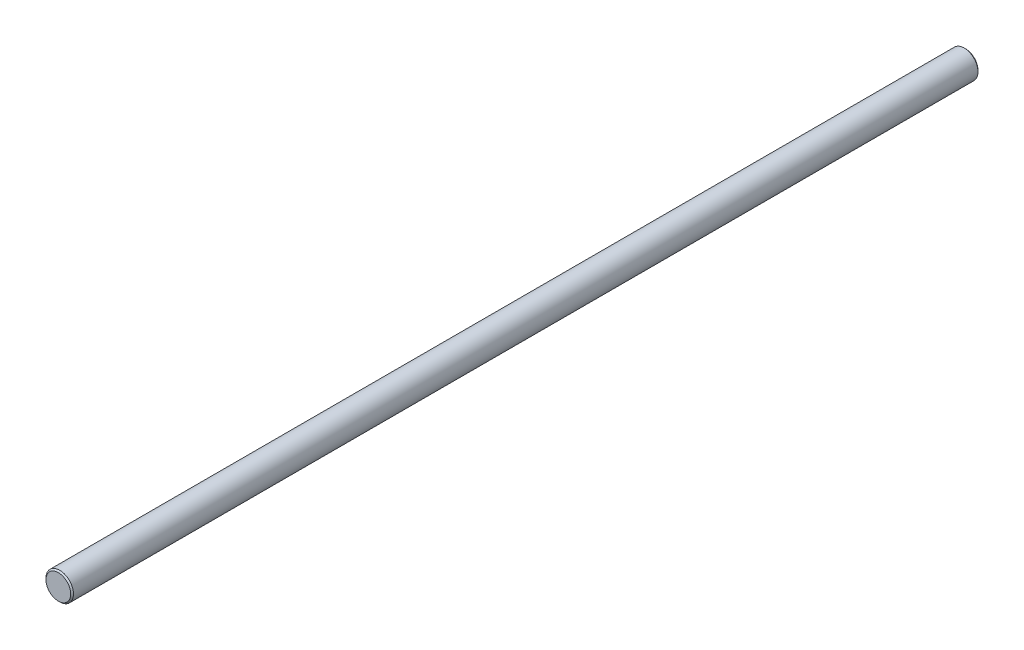
ISO-10303-21;
HEADER;
FILE_DESCRIPTION(('STEP AP214'),'2;1');
FILE_NAME('part.step','',(''),(''),'','','');
FILE_SCHEMA(('AUTOMOTIVE_DESIGN { 1 0 10303 214 1 1 1 1 }'));
ENDSEC;
DATA;
#1=APPLICATION_CONTEXT('core data for automotive mechanical design processes');
#2=APPLICATION_PROTOCOL_DEFINITION('international standard','automotive_design',2000,#1);
#3=PRODUCT_CONTEXT('',#1,'mechanical');
#4=PRODUCT('Part','Part','',(#3));
#5=PRODUCT_RELATED_PRODUCT_CATEGORY('part','',(#4));
#6=PRODUCT_DEFINITION_FORMATION('','',#4);
#7=PRODUCT_DEFINITION_CONTEXT('part definition',#1,'design');
#8=PRODUCT_DEFINITION('design','',#6,#7);
#9=PRODUCT_DEFINITION_SHAPE('','',#8);
#10=(LENGTH_UNIT() NAMED_UNIT(*) SI_UNIT(.MILLI.,.METRE.));
#11=(NAMED_UNIT(*) PLANE_ANGLE_UNIT() SI_UNIT($,.RADIAN.));
#12=(NAMED_UNIT(*) SI_UNIT($,.STERADIAN.) SOLID_ANGLE_UNIT());
#13=UNCERTAINTY_MEASURE_WITH_UNIT(LENGTH_MEASURE(1.E-05),#10,'distance_accuracy_value','');
#14=(GEOMETRIC_REPRESENTATION_CONTEXT(3) GLOBAL_UNCERTAINTY_ASSIGNED_CONTEXT((#13)) GLOBAL_UNIT_ASSIGNED_CONTEXT((#10,
#11,#12)) REPRESENTATION_CONTEXT('',''));
#15=CARTESIAN_POINT('',(0.,0.,0.));
#16=DIRECTION('',(0.,0.,1.));
#17=DIRECTION('',(1.,0.,0.));
#18=AXIS2_PLACEMENT_3D('',#15,#16,#17);
#19=CARTESIAN_POINT('',(0.,0.,-330.));
#20=DIRECTION('',(0.,0.,1.));
#21=DIRECTION('',(1.,0.,0.));
#22=AXIS2_PLACEMENT_3D('',#19,#20,#21);
#23=CYLINDRICAL_SURFACE('',#22,5.);
#24=CARTESIAN_POINT('',(0.,0.,-329.5));
#25=DIRECTION('',(0.,0.,1.));
#26=DIRECTION('',(1.,0.,0.));
#27=AXIS2_PLACEMENT_3D('',#24,#25,#26);
#28=CIRCLE('',#27,5.);
#29=CARTESIAN_POINT('',(5.,0.,-329.5));
#30=VERTEX_POINT('',#29);
#31=EDGE_CURVE('E46',#30,#30,#28,.T.);
#32=ORIENTED_EDGE('',*,*,#31,.T.);
#33=EDGE_LOOP('',(#32));
#34=FACE_BOUND('',#33,.T.);
#35=CARTESIAN_POINT('',(0.,0.,-0.5));
#36=DIRECTION('',(0.,0.,1.));
#37=DIRECTION('',(1.,0.,0.));
#38=AXIS2_PLACEMENT_3D('',#35,#36,#37);
#39=CIRCLE('',#38,5.);
#40=CARTESIAN_POINT('',(5.,0.,-0.5));
#41=VERTEX_POINT('',#40);
#42=EDGE_CURVE('E50',#41,#41,#39,.F.);
#43=ORIENTED_EDGE('',*,*,#42,.T.);
#44=EDGE_LOOP('',(#43));
#45=FACE_BOUND('',#44,.T.);
#46=ADVANCED_FACE('F35',(#34,#45),#23,.T.);
#47=CARTESIAN_POINT('',(0.,0.,-330.));
#48=DIRECTION('',(0.,0.,1.));
#49=DIRECTION('',(1.,0.,0.));
#50=AXIS2_PLACEMENT_3D('',#47,#48,#49);
#51=PLANE('',#50);
#52=CARTESIAN_POINT('',(0.,0.,-330.));
#53=DIRECTION('',(0.,0.,1.));
#54=DIRECTION('',(1.,0.,0.));
#55=AXIS2_PLACEMENT_3D('',#52,#53,#54);
#56=CIRCLE('',#55,4.50000000000006);
#57=CARTESIAN_POINT('',(4.50000000000006,0.,-330.));
#58=VERTEX_POINT('',#57);
#59=EDGE_CURVE('E42',#58,#58,#56,.F.);
#60=ORIENTED_EDGE('',*,*,#59,.T.);
#61=EDGE_LOOP('',(#60));
#62=FACE_BOUND('',#61,.T.);
#63=ADVANCED_FACE('F66',(#62),#51,.F.);
#64=CARTESIAN_POINT('',(0.,0.,0.));
#65=DIRECTION('',(0.,0.,1.));
#66=DIRECTION('',(1.,0.,0.));
#67=AXIS2_PLACEMENT_3D('',#64,#65,#66);
#68=PLANE('',#67);
#69=CARTESIAN_POINT('',(0.,0.,0.));
#70=DIRECTION('',(0.,0.,1.));
#71=DIRECTION('',(1.,0.,0.));
#72=AXIS2_PLACEMENT_3D('',#69,#70,#71);
#73=CIRCLE('',#72,4.5);
#74=CARTESIAN_POINT('',(4.5,0.,0.));
#75=VERTEX_POINT('',#74);
#76=EDGE_CURVE('E10',#75,#75,#73,.T.);
#77=ORIENTED_EDGE('',*,*,#76,.T.);
#78=EDGE_LOOP('',(#77));
#79=FACE_BOUND('',#78,.T.);
#80=ADVANCED_FACE('F63',(#79),#68,.T.);
#81=CARTESIAN_POINT('',(0.,0.,-329.5));
#82=DIRECTION('',(0.,0.,1.));
#83=DIRECTION('',(1.,0.,0.));
#84=AXIS2_PLACEMENT_3D('',#81,#82,#83);
#85=CONICAL_SURFACE('',#84,5.,0.785398163397555);
#86=ORIENTED_EDGE('',*,*,#59,.F.);
#87=EDGE_LOOP('',(#86));
#88=FACE_BOUND('',#87,.T.);
#89=ORIENTED_EDGE('',*,*,#31,.F.);
#90=EDGE_LOOP('',(#89));
#91=FACE_BOUND('',#90,.T.);
#92=ADVANCED_FACE('F59',(#88,#91),#85,.T.);
#93=CARTESIAN_POINT('',(0.,0.,0.));
#94=DIRECTION('',(0.,0.,-1.));
#95=DIRECTION('',(-1.,0.,0.));
#96=AXIS2_PLACEMENT_3D('',#93,#94,#95);
#97=CONICAL_SURFACE('',#96,4.5,0.785398163397444);
#98=ORIENTED_EDGE('',*,*,#42,.F.);
#99=EDGE_LOOP('',(#98));
#100=FACE_BOUND('',#99,.T.);
#101=ORIENTED_EDGE('',*,*,#76,.F.);
#102=EDGE_LOOP('',(#101));
#103=FACE_BOUND('',#102,.T.);
#104=ADVANCED_FACE('F37',(#100,#103),#97,.T.);
#105=CLOSED_SHELL('',(#46,#63,#80,#92,#104));
#106=MANIFOLD_SOLID_BREP('B2',#105);
#107=ADVANCED_BREP_SHAPE_REPRESENTATION('',(#18,#106),#14);
#108=SHAPE_DEFINITION_REPRESENTATION(#9,#107);
ENDSEC;
END-ISO-10303-21;
